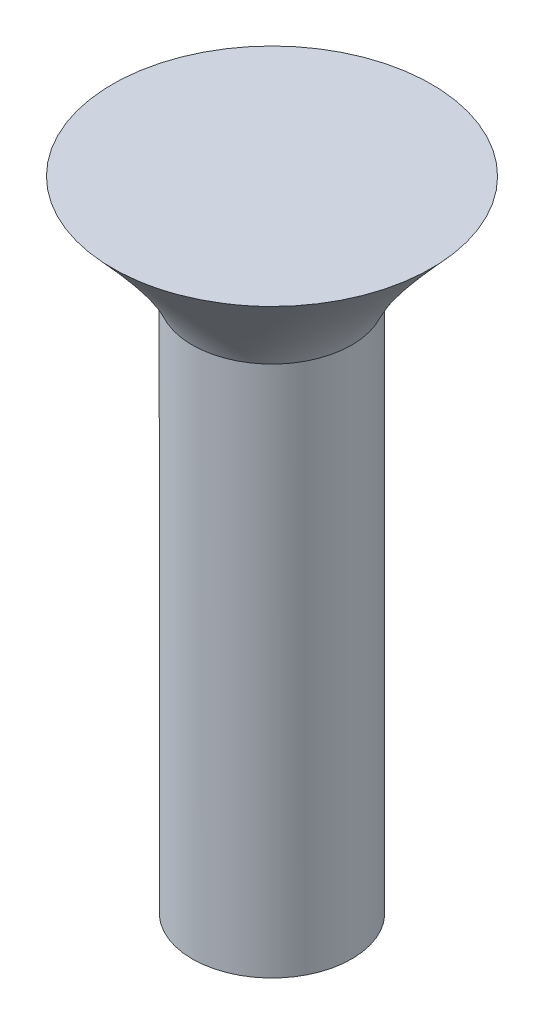
ISO-10303-21;
HEADER;
FILE_DESCRIPTION(('STEP AP214'),'2;1');
FILE_NAME('part.step','',(''),(''),'','','');
FILE_SCHEMA(('AUTOMOTIVE_DESIGN { 1 0 10303 214 1 1 1 1 }'));
ENDSEC;
DATA;
#1=APPLICATION_CONTEXT('core data for automotive mechanical design processes');
#2=APPLICATION_PROTOCOL_DEFINITION('international standard','automotive_design',2000,#1);
#3=PRODUCT_CONTEXT('',#1,'mechanical');
#4=PRODUCT('Part','Part','',(#3));
#5=PRODUCT_RELATED_PRODUCT_CATEGORY('part','',(#4));
#6=PRODUCT_DEFINITION_FORMATION('','',#4);
#7=PRODUCT_DEFINITION_CONTEXT('part definition',#1,'design');
#8=PRODUCT_DEFINITION('design','',#6,#7);
#9=PRODUCT_DEFINITION_SHAPE('','',#8);
#10=(LENGTH_UNIT() NAMED_UNIT(*) SI_UNIT(.MILLI.,.METRE.));
#11=(NAMED_UNIT(*) PLANE_ANGLE_UNIT() SI_UNIT($,.RADIAN.));
#12=(NAMED_UNIT(*) SI_UNIT($,.STERADIAN.) SOLID_ANGLE_UNIT());
#13=UNCERTAINTY_MEASURE_WITH_UNIT(LENGTH_MEASURE(1.E-05),#10,'distance_accuracy_value','');
#14=(GEOMETRIC_REPRESENTATION_CONTEXT(3) GLOBAL_UNCERTAINTY_ASSIGNED_CONTEXT((#13)) GLOBAL_UNIT_ASSIGNED_CONTEXT((#10,
#11,#12)) REPRESENTATION_CONTEXT('',''));
#15=CARTESIAN_POINT('',(0.,0.,0.));
#16=DIRECTION('',(0.,0.,1.));
#17=DIRECTION('',(1.,0.,0.));
#18=AXIS2_PLACEMENT_3D('',#15,#16,#17);
#19=CARTESIAN_POINT('',(0.,20.,0.));
#20=DIRECTION('',(0.,-1.,0.));
#21=DIRECTION('',(0.,0.,-1.));
#22=AXIS2_PLACEMENT_3D('',#19,#20,#21);
#23=CYLINDRICAL_SURFACE('',#22,3.);
#24=CARTESIAN_POINT('',(0.,20.,0.));
#25=DIRECTION('',(0.,-1.,0.));
#26=DIRECTION('',(0.,0.,-1.));
#27=AXIS2_PLACEMENT_3D('',#24,#25,#26);
#28=CIRCLE('',#27,3.);
#29=CARTESIAN_POINT('',(-2.73420982990634,20.,-1.23454307581533));
#30=VERTEX_POINT('',#29);
#31=EDGE_CURVE('E11',#30,#30,#28,.F.);
#32=ORIENTED_EDGE('',*,*,#31,.F.);
#33=EDGE_LOOP('',(#32));
#34=FACE_BOUND('',#33,.T.);
#35=CARTESIAN_POINT('',(0.,0.,0.));
#36=DIRECTION('',(0.,1.,0.));
#37=DIRECTION('',(0.,0.,1.));
#38=AXIS2_PLACEMENT_3D('',#35,#36,#37);
#39=CIRCLE('',#38,3.);
#40=CARTESIAN_POINT('',(0.,0.,3.));
#41=VERTEX_POINT('',#40);
#42=EDGE_CURVE('E45',#41,#41,#39,.T.);
#43=ORIENTED_EDGE('',*,*,#42,.T.);
#44=EDGE_LOOP('',(#43));
#45=FACE_BOUND('',#44,.T.);
#46=ADVANCED_FACE('F38',(#34,#45),#23,.T.);
#47=CARTESIAN_POINT('',(0.,0.,0.));
#48=DIRECTION('',(0.,1.,0.));
#49=DIRECTION('',(0.,0.,1.));
#50=AXIS2_PLACEMENT_3D('',#47,#48,#49);
#51=PLANE('',#50);
#52=ORIENTED_EDGE('',*,*,#42,.F.);
#53=EDGE_LOOP('',(#52));
#54=FACE_BOUND('',#53,.T.);
#55=ADVANCED_FACE('F71',(#54),#51,.F.);
#56=CARTESIAN_POINT('',(0.,24.000000128,0.));
#57=DIRECTION('',(0.,1.,0.));
#58=DIRECTION('',(0.,0.,1.));
#59=AXIS2_PLACEMENT_3D('',#56,#57,#58);
#60=PLANE('',#59);
#61=CARTESIAN_POINT('',(0.,24.000000128,0.));
#62=DIRECTION('',(0.,1.,0.));
#63=DIRECTION('',(0.,0.,1.));
#64=AXIS2_PLACEMENT_3D('',#61,#62,#63);
#65=CIRCLE('',#64,6.);
#66=CARTESIAN_POINT('',(-2.70376959678164,24.000000128,-5.3562701544563));
#67=VERTEX_POINT('',#66);
#68=EDGE_CURVE('E49',#67,#67,#65,.T.);
#69=ORIENTED_EDGE('',*,*,#68,.T.);
#70=EDGE_LOOP('',(#69));
#71=FACE_BOUND('',#70,.T.);
#72=ADVANCED_FACE('F61',(#71),#60,.T.);
#73=CARTESIAN_POINT('',(-2.73420982990634,20.,-1.23454307581533));
#74=CARTESIAN_POINT('',(-2.70376959678164,24.000000128,-5.3562701544563));
#75=CARTESIAN_POINT('',(-5.20329598153699,20.,4.23387658399734));
#76=CARTESIAN_POINT('',(-13.4163099056942,24.000000128,0.0512690391069812));
#77=CARTESIAN_POINT('',(0.265123678275681,20.,6.702962735628));
#78=CARTESIAN_POINT('',(-8.00877071213095,24.000000128,10.7638093480196));
#79=CARTESIAN_POINT('',(2.73420982990634,20.,1.23454307581533));
#80=CARTESIAN_POINT('',(2.70376959678164,24.000000128,5.3562701544563));
#81=CARTESIAN_POINT('',(5.20329598153699,20.,-4.23387658399734));
#82=CARTESIAN_POINT('',(13.4163099056942,24.000000128,-0.0512690391069855));
#83=CARTESIAN_POINT('',(-0.265123678275681,20.,-6.702962735628));
#84=CARTESIAN_POINT('',(8.00877071213095,24.000000128,-10.7638093480196));
#85=CARTESIAN_POINT('',(-2.73420982990634,20.,-1.23454307581533));
#86=CARTESIAN_POINT('',(-2.70376959678164,24.000000128,-5.3562701544563));
#87=(BOUNDED_SURFACE() B_SPLINE_SURFACE(3,1,((#73,#74),(#75,#76),(#77,#78),(#79,#80),(#81,#82),
(#83,#84),(#85,#86)),.UNSPECIFIED.,.T.,.F.,.F.) B_SPLINE_SURFACE_WITH_KNOTS((4,3,4),(2,2),(0.,
0.5,1.),(0.,1.),.UNSPECIFIED.) GEOMETRIC_REPRESENTATION_ITEM() RATIONAL_B_SPLINE_SURFACE(((1.,
1.),(0.333333333333333,0.333333333333333),(0.333333333333333,0.333333333333333),(1.,1.),
(0.333333333333333,0.333333333333333),(0.333333333333333,0.333333333333333),(1.,1.))) REPRESENTATION_ITEM('') SURFACE());
#88=CARTESIAN_POINT('',(-2.73420982990634,20.,-1.23454307581533));
#89=CARTESIAN_POINT('',(-2.73389274414462,20.041666668,-1.27747773288451));
#90=CARTESIAN_POINT('',(-2.7335756583829,20.083333336,-1.32041238995368));
#91=CARTESIAN_POINT('',(-2.73294148685947,20.166666672,-1.40628170409203));
#92=CARTESIAN_POINT('',(-2.73262440109776,20.20833334,-1.44921636116121));
#93=CARTESIAN_POINT('',(-2.73199022957433,20.291666676,-1.53508567529956));
#94=CARTESIAN_POINT('',(-2.73167314381261,20.333333344,-1.57802033236874));
#95=CARTESIAN_POINT('',(-2.73103897228918,20.41666668,-1.6638896465071));
#96=CARTESIAN_POINT('',(-2.73072188652746,20.458333348,-1.70682430357627));
#97=CARTESIAN_POINT('',(-2.73008771500403,20.541666684,-1.79269361771463));
#98=CARTESIAN_POINT('',(-2.72977062924232,20.583333352,-1.8356282747838));
#99=CARTESIAN_POINT('',(-2.72913645771889,20.666666688,-1.92149758892216));
#100=CARTESIAN_POINT('',(-2.72881937195717,20.708333356,-1.96443224599133));
#101=CARTESIAN_POINT('',(-2.72818520043374,20.791666692,-2.05030156012969));
#102=CARTESIAN_POINT('',(-2.72786811467202,20.83333336,-2.09323621719886));
#103=CARTESIAN_POINT('',(-2.72723394314859,20.916666696,-2.17910553133722));
#104=CARTESIAN_POINT('',(-2.72691685738688,20.958333364,-2.22204018840639));
#105=CARTESIAN_POINT('',(-2.72628268586345,21.0416667,-2.30790950254475));
#106=CARTESIAN_POINT('',(-2.72596560010173,21.083333368,-2.35084415961392));
#107=CARTESIAN_POINT('',(-2.7253314285783,21.166666704,-2.43671347375228));
#108=CARTESIAN_POINT('',(-2.72501434281658,21.208333372,-2.47964813082145));
#109=CARTESIAN_POINT('',(-2.72438017129315,21.291666708,-2.56551744495981));
#110=CARTESIAN_POINT('',(-2.72406308553144,21.333333376,-2.60845210202898));
#111=CARTESIAN_POINT('',(-2.72342891400801,21.416666712,-2.69432141616734));
#112=CARTESIAN_POINT('',(-2.72311182824629,21.45833338,-2.73725607323651));
#113=CARTESIAN_POINT('',(-2.72247765672286,21.541666716,-2.82312538737487));
#114=CARTESIAN_POINT('',(-2.72216057096114,21.583333384,-2.86606004444404));
#115=CARTESIAN_POINT('',(-2.72152639943771,21.66666672,-2.9519293585824));
#116=CARTESIAN_POINT('',(-2.721209313676,21.708333388,-2.99486401565157));
#117=CARTESIAN_POINT('',(-2.72057514215256,21.791666724,-3.08073332978993));
#118=CARTESIAN_POINT('',(-2.72025805639085,21.833333392,-3.1236679868591));
#119=CARTESIAN_POINT('',(-2.71962388486742,21.916666728,-3.20953730099746));
#120=CARTESIAN_POINT('',(-2.7193067991057,21.958333396,-3.25247195806664));
#121=CARTESIAN_POINT('',(-2.71867262758227,22.041666732,-3.33834127220499));
#122=CARTESIAN_POINT('',(-2.71835554182056,22.0833334,-3.38127592927417));
#123=CARTESIAN_POINT('',(-2.71772137029712,22.166666736,-3.46714524341252));
#124=CARTESIAN_POINT('',(-2.71740428453541,22.208333404,-3.5100799004817));
#125=CARTESIAN_POINT('',(-2.71677011301198,22.29166674,-3.59594921462005));
#126=CARTESIAN_POINT('',(-2.71645302725026,22.333333408,-3.63888387168923));
#127=CARTESIAN_POINT('',(-2.71581885572683,22.416666744,-3.72475318582758));
#128=CARTESIAN_POINT('',(-2.71550176996511,22.458333412,-3.76768784289676));
#129=CARTESIAN_POINT('',(-2.71486759844168,22.541666748,-3.85355715703511));
#130=CARTESIAN_POINT('',(-2.71455051267997,22.583333416,-3.89649181410429));
#131=CARTESIAN_POINT('',(-2.71391634115654,22.666666752,-3.98236112824264));
#132=CARTESIAN_POINT('',(-2.71359925539482,22.70833342,-4.02529578531182));
#133=CARTESIAN_POINT('',(-2.71296508387139,22.791666756,-4.11116509945017));
#134=CARTESIAN_POINT('',(-2.71264799810967,22.833333424,-4.15409975651935));
#135=CARTESIAN_POINT('',(-2.71201382658624,22.91666676,-4.2399690706577));
#136=CARTESIAN_POINT('',(-2.71169674082453,22.958333428,-4.28290372772688));
#137=CARTESIAN_POINT('',(-2.7110625693011,23.041666764,-4.36877304186523));
#138=CARTESIAN_POINT('',(-2.71074548353938,23.083333432,-4.41170769893441));
#139=CARTESIAN_POINT('',(-2.71011131201595,23.166666768,-4.49757701307276));
#140=CARTESIAN_POINT('',(-2.70979422625423,23.208333436,-4.54051167014194));
#141=CARTESIAN_POINT('',(-2.7091600547308,23.291666772,-4.62638098428029));
#142=CARTESIAN_POINT('',(-2.70884296896909,23.33333344,-4.66931564134947));
#143=CARTESIAN_POINT('',(-2.70820879744566,23.416666776,-4.75518495548782));
#144=CARTESIAN_POINT('',(-2.70789171168394,23.458333444,-4.798119612557));
#145=CARTESIAN_POINT('',(-2.70725754016051,23.54166678,-4.88398892669535));
#146=CARTESIAN_POINT('',(-2.70694045439879,23.583333448,-4.92692358376453));
#147=CARTESIAN_POINT('',(-2.70630628287536,23.666666784,-5.01279289790288));
#148=CARTESIAN_POINT('',(-2.70598919711365,23.708333452,-5.05572755497206));
#149=CARTESIAN_POINT('',(-2.70535502559022,23.791666788,-5.14159686911041));
#150=CARTESIAN_POINT('',(-2.7050379398285,23.833333456,-5.18453152617959));
#151=CARTESIAN_POINT('',(-2.70440376830507,23.916666792,-5.27040084031794));
#152=CARTESIAN_POINT('',(-2.70408668254335,23.95833346,-5.31333549738712));
#153=CARTESIAN_POINT('',(-2.70376959678164,24.000000128,-5.3562701544563));
#154=B_SPLINE_CURVE_WITH_KNOTS('',3,(#88,#89,#90,#91,#92,#93,#94,#95,#96,#97,#98,#99,#100,#101,
#102,#103,#104,#105,#106,#107,#108,#109,#110,#111,#112,#113,#114,#115,#116,#117,#118,#119,#120,
#121,#122,#123,#124,#125,#126,#127,#128,#129,#130,#131,#132,#133,#134,#135,#136,#137,#138,#139,
#140,#141,#142,#143,#144,#145,#146,#147,#148,#149,#150,#151,#152,#153),.UNSPECIFIED.,.F.,.F.,(4,
2,2,2,2,2,2,2,2,2,2,2,2,2,2,2,2,2,2,2,2,2,2,2,2,2,2,2,2,2,2,2,4),(0.,0.179489188780975,
0.358978377561952,0.538467566342927,0.717956755123904,0.897445943904879,1.07693513268586,
1.25642432146683,1.43591351024781,1.61540269902878,1.79489188780976,1.97438107659074,
2.15387026537171,2.33335945415269,2.51284864293366,2.69233783171464,2.87182702049561,
3.05131620927659,3.23080539805757,3.41029458683854,3.58978377561952,3.7692729644005,
3.94876215318147,4.12825134196245,4.30774053074343,4.4872297195244,4.66671890830537,
4.84620809708635,5.02569728586733,5.2051864746483,5.38467566342928,5.56416485221026,
5.74365404099123),.UNSPECIFIED.);
#155=EDGE_CURVE('BSEAM70',#30,#67,#154,.T.);
#156=ORIENTED_EDGE('',*,*,#31,.T.);
#157=ORIENTED_EDGE('',*,*,#68,.F.);
#158=ORIENTED_EDGE('',*,*,#155,.T.);
#159=ORIENTED_EDGE('',*,*,#155,.F.);
#160=EDGE_LOOP('',(#156,#158,#157,#159));
#161=FACE_BOUND('',#160,.T.);
#162=ADVANCED_FACE('F70',(#161),#87,.T.);
#163=CLOSED_SHELL('',(#46,#55,#72,#162));
#164=MANIFOLD_SOLID_BREP('B2',#163);
#165=ADVANCED_BREP_SHAPE_REPRESENTATION('',(#18,#164),#14);
#166=SHAPE_DEFINITION_REPRESENTATION(#9,#165);
ENDSEC;
END-ISO-10303-21;
